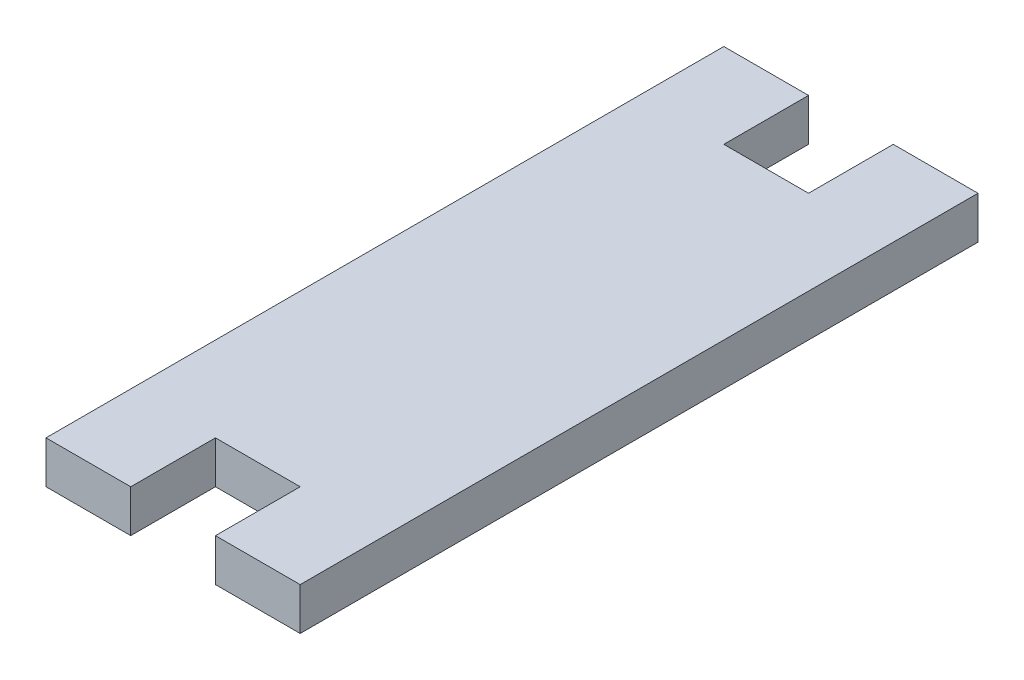
ISO-10303-21;
HEADER;
FILE_DESCRIPTION(('STEP AP214'),'2;1');
FILE_NAME('part.step','',(''),(''),'','','');
FILE_SCHEMA(('AUTOMOTIVE_DESIGN { 1 0 10303 214 1 1 1 1 }'));
ENDSEC;
DATA;
#1=APPLICATION_CONTEXT('core data for automotive mechanical design processes');
#2=APPLICATION_PROTOCOL_DEFINITION('international standard','automotive_design',2000,#1);
#3=PRODUCT_CONTEXT('',#1,'mechanical');
#4=PRODUCT('Part','Part','',(#3));
#5=PRODUCT_RELATED_PRODUCT_CATEGORY('part','',(#4));
#6=PRODUCT_DEFINITION_FORMATION('','',#4);
#7=PRODUCT_DEFINITION_CONTEXT('part definition',#1,'design');
#8=PRODUCT_DEFINITION('design','',#6,#7);
#9=PRODUCT_DEFINITION_SHAPE('','',#8);
#10=(LENGTH_UNIT() NAMED_UNIT(*) SI_UNIT(.MILLI.,.METRE.));
#11=(NAMED_UNIT(*) PLANE_ANGLE_UNIT() SI_UNIT($,.RADIAN.));
#12=(NAMED_UNIT(*) SI_UNIT($,.STERADIAN.) SOLID_ANGLE_UNIT());
#13=UNCERTAINTY_MEASURE_WITH_UNIT(LENGTH_MEASURE(1.E-05),#10,'distance_accuracy_value','');
#14=(GEOMETRIC_REPRESENTATION_CONTEXT(3) GLOBAL_UNCERTAINTY_ASSIGNED_CONTEXT((#13)) GLOBAL_UNIT_ASSIGNED_CONTEXT((#10,
#11,#12)) REPRESENTATION_CONTEXT('',''));
#15=CARTESIAN_POINT('',(0.,0.,0.));
#16=DIRECTION('',(0.,0.,1.));
#17=DIRECTION('',(1.,0.,0.));
#18=AXIS2_PLACEMENT_3D('',#15,#16,#17);
#19=CARTESIAN_POINT('',(0.,5.,0.));
#20=DIRECTION('',(0.,1.,0.));
#21=DIRECTION('',(0.,0.,1.));
#22=AXIS2_PLACEMENT_3D('',#19,#20,#21);
#23=PLANE('',#22);
#24=DIRECTION('',(-1.,0.,0.));
#25=VECTOR('',#24,1.);
#26=CARTESIAN_POINT('',(-29.9699480181936,5.,35.3086419753086));
#27=LINE('',#26,#25);
#28=CARTESIAN_POINT('',(-19.9699480181936,5.,35.3086419753086));
#29=VERTEX_POINT('',#28);
#30=CARTESIAN_POINT('',(-29.9699480181936,5.,35.3086419753086));
#31=VERTEX_POINT('',#30);
#32=EDGE_CURVE('E144',#29,#31,#27,.T.);
#33=ORIENTED_EDGE('',*,*,#32,.F.);
#34=DIRECTION('',(0.,0.,-1.));
#35=VECTOR('',#34,1.);
#36=CARTESIAN_POINT('',(-19.9699480181937,5.,45.3086419753086));
#37=LINE('',#36,#35);
#38=CARTESIAN_POINT('',(-19.9699480181937,5.,45.3086419753086));
#39=VERTEX_POINT('',#38);
#40=EDGE_CURVE('E130',#39,#29,#37,.T.);
#41=ORIENTED_EDGE('',*,*,#40,.F.);
#42=DIRECTION('',(1.,0.,0.));
#43=VECTOR('',#42,1.);
#44=CARTESIAN_POINT('',(-39.9699480181936,5.,45.3086419753086));
#45=LINE('',#44,#43);
#46=CARTESIAN_POINT('',(-9.96994801819363,5.,45.3086419753086));
#47=VERTEX_POINT('',#46);
#48=EDGE_CURVE('E142',#39,#47,#45,.T.);
#49=ORIENTED_EDGE('',*,*,#48,.T.);
#50=DIRECTION('',(0.,0.,-1.));
#51=VECTOR('',#50,1.);
#52=CARTESIAN_POINT('',(-9.96994801819364,5.,-34.6913580246914));
#53=LINE('',#52,#51);
#54=CARTESIAN_POINT('',(-9.96994801819364,5.,-34.6913580246914));
#55=VERTEX_POINT('',#54);
#56=EDGE_CURVE('E154',#47,#55,#53,.T.);
#57=ORIENTED_EDGE('',*,*,#56,.T.);
#58=DIRECTION('',(-1.,0.,0.));
#59=VECTOR('',#58,1.);
#60=CARTESIAN_POINT('',(-39.9699480181936,5.,-34.6913580246914));
#61=LINE('',#60,#59);
#62=CARTESIAN_POINT('',(-19.9699480181936,5.,-34.6913580246914));
#63=VERTEX_POINT('',#62);
#64=EDGE_CURVE('E162',#55,#63,#61,.T.);
#65=ORIENTED_EDGE('',*,*,#64,.T.);
#66=DIRECTION('',(0.,0.,-1.));
#67=VECTOR('',#66,1.);
#68=CARTESIAN_POINT('',(-19.9699480181936,5.,-34.6913580246914));
#69=LINE('',#68,#67);
#70=CARTESIAN_POINT('',(-19.9699480181936,5.,-24.6913580246914));
#71=VERTEX_POINT('',#70);
#72=EDGE_CURVE('E197',#71,#63,#69,.T.);
#73=ORIENTED_EDGE('',*,*,#72,.F.);
#74=DIRECTION('',(1.,0.,0.));
#75=VECTOR('',#74,1.);
#76=CARTESIAN_POINT('',(-29.9699480181936,5.,-24.6913580246914));
#77=LINE('',#76,#75);
#78=CARTESIAN_POINT('',(-29.9699480181936,5.,-24.6913580246914));
#79=VERTEX_POINT('',#78);
#80=EDGE_CURVE('E199',#79,#71,#77,.T.);
#81=ORIENTED_EDGE('',*,*,#80,.F.);
#82=DIRECTION('',(0.,0.,1.));
#83=VECTOR('',#82,1.);
#84=CARTESIAN_POINT('',(-29.9699480181936,5.,-34.6913580246914));
#85=LINE('',#84,#83);
#86=CARTESIAN_POINT('',(-29.9699480181936,5.,-34.6913580246914));
#87=VERTEX_POINT('',#86);
#88=EDGE_CURVE('E205',#87,#79,#85,.T.);
#89=ORIENTED_EDGE('',*,*,#88,.F.);
#90=CARTESIAN_POINT('',(-39.9699480181936,5.,-34.6913580246914));
#91=VERTEX_POINT('',#90);
#92=EDGE_CURVE('E161',#87,#91,#61,.T.);
#93=ORIENTED_EDGE('',*,*,#92,.T.);
#94=DIRECTION('',(0.,0.,1.));
#95=VECTOR('',#94,1.);
#96=CARTESIAN_POINT('',(-39.9699480181936,5.,-34.6913580246914));
#97=LINE('',#96,#95);
#98=CARTESIAN_POINT('',(-39.9699480181936,5.,45.3086419753086));
#99=VERTEX_POINT('',#98);
#100=EDGE_CURVE('E151',#91,#99,#97,.T.);
#101=ORIENTED_EDGE('',*,*,#100,.T.);
#102=CARTESIAN_POINT('',(-29.9699480181936,5.,45.3086419753086));
#103=VERTEX_POINT('',#102);
#104=EDGE_CURVE('E150',#99,#103,#45,.T.);
#105=ORIENTED_EDGE('',*,*,#104,.T.);
#106=DIRECTION('',(0.,0.,1.));
#107=VECTOR('',#106,1.);
#108=CARTESIAN_POINT('',(-29.9699480181936,5.,45.3086419753086));
#109=LINE('',#108,#107);
#110=EDGE_CURVE('E52',#31,#103,#109,.T.);
#111=ORIENTED_EDGE('',*,*,#110,.F.);
#112=EDGE_LOOP('',(#33,#41,#49,#57,#65,#73,#81,#89,#93,#101,#105,#111));
#113=FACE_BOUND('',#112,.T.);
#114=ADVANCED_FACE('F37',(#113),#23,.T.);
#115=CARTESIAN_POINT('',(0.,0.,0.));
#116=DIRECTION('',(0.,1.,0.));
#117=DIRECTION('',(0.,0.,1.));
#118=AXIS2_PLACEMENT_3D('',#115,#116,#117);
#119=PLANE('',#118);
#120=DIRECTION('',(0.,0.,-1.));
#121=VECTOR('',#120,1.);
#122=CARTESIAN_POINT('',(-19.9699480181937,0.,45.3086419753086));
#123=LINE('',#122,#121);
#124=CARTESIAN_POINT('',(-19.9699480181937,0.,45.3086419753086));
#125=VERTEX_POINT('',#124);
#126=CARTESIAN_POINT('',(-19.9699480181936,0.,35.3086419753086));
#127=VERTEX_POINT('',#126);
#128=EDGE_CURVE('E133',#125,#127,#123,.T.);
#129=ORIENTED_EDGE('',*,*,#128,.T.);
#130=DIRECTION('',(-1.,0.,0.));
#131=VECTOR('',#130,1.);
#132=CARTESIAN_POINT('',(-29.9699480181936,0.,35.3086419753086));
#133=LINE('',#132,#131);
#134=CARTESIAN_POINT('',(-29.9699480181936,0.,35.3086419753086));
#135=VERTEX_POINT('',#134);
#136=EDGE_CURVE('E238',#127,#135,#133,.T.);
#137=ORIENTED_EDGE('',*,*,#136,.T.);
#138=DIRECTION('',(0.,0.,1.));
#139=VECTOR('',#138,1.);
#140=CARTESIAN_POINT('',(-29.9699480181936,0.,45.3086419753086));
#141=LINE('',#140,#139);
#142=CARTESIAN_POINT('',(-29.9699480181936,0.,45.3086419753086));
#143=VERTEX_POINT('',#142);
#144=EDGE_CURVE('E145',#135,#143,#141,.T.);
#145=ORIENTED_EDGE('',*,*,#144,.T.);
#146=DIRECTION('',(1.,0.,0.));
#147=VECTOR('',#146,1.);
#148=CARTESIAN_POINT('',(-39.9699480181936,0.,45.3086419753086));
#149=LINE('',#148,#147);
#150=CARTESIAN_POINT('',(-39.9699480181936,0.,45.3086419753086));
#151=VERTEX_POINT('',#150);
#152=EDGE_CURVE('E171',#151,#143,#149,.T.);
#153=ORIENTED_EDGE('',*,*,#152,.F.);
#154=DIRECTION('',(0.,0.,1.));
#155=VECTOR('',#154,1.);
#156=CARTESIAN_POINT('',(-39.9699480181936,0.,-34.6913580246914));
#157=LINE('',#156,#155);
#158=CARTESIAN_POINT('',(-39.9699480181936,0.,-34.6913580246914));
#159=VERTEX_POINT('',#158);
#160=EDGE_CURVE('E166',#159,#151,#157,.T.);
#161=ORIENTED_EDGE('',*,*,#160,.F.);
#162=DIRECTION('',(-1.,0.,0.));
#163=VECTOR('',#162,1.);
#164=CARTESIAN_POINT('',(-39.9699480181936,0.,-34.6913580246914));
#165=LINE('',#164,#163);
#166=CARTESIAN_POINT('',(-29.9699480181936,0.,-34.6913580246914));
#167=VERTEX_POINT('',#166);
#168=EDGE_CURVE('E176',#167,#159,#165,.T.);
#169=ORIENTED_EDGE('',*,*,#168,.F.);
#170=DIRECTION('',(0.,0.,1.));
#171=VECTOR('',#170,1.);
#172=CARTESIAN_POINT('',(-29.9699480181936,0.,-34.6913580246914));
#173=LINE('',#172,#171);
#174=CARTESIAN_POINT('',(-29.9699480181936,0.,-24.6913580246914));
#175=VERTEX_POINT('',#174);
#176=EDGE_CURVE('E137',#167,#175,#173,.T.);
#177=ORIENTED_EDGE('',*,*,#176,.T.);
#178=DIRECTION('',(1.,0.,0.));
#179=VECTOR('',#178,1.);
#180=CARTESIAN_POINT('',(-29.9699480181936,0.,-24.6913580246914));
#181=LINE('',#180,#179);
#182=CARTESIAN_POINT('',(-19.9699480181936,0.,-24.6913580246914));
#183=VERTEX_POINT('',#182);
#184=EDGE_CURVE('E211',#175,#183,#181,.T.);
#185=ORIENTED_EDGE('',*,*,#184,.T.);
#186=DIRECTION('',(0.,0.,-1.));
#187=VECTOR('',#186,1.);
#188=CARTESIAN_POINT('',(-19.9699480181936,0.,-34.6913580246914));
#189=LINE('',#188,#187);
#190=CARTESIAN_POINT('',(-19.9699480181936,0.,-34.6913580246914));
#191=VERTEX_POINT('',#190);
#192=EDGE_CURVE('E191',#183,#191,#189,.T.);
#193=ORIENTED_EDGE('',*,*,#192,.T.);
#194=CARTESIAN_POINT('',(-9.96994801819364,0.,-34.6913580246914));
#195=VERTEX_POINT('',#194);
#196=EDGE_CURVE('E156',#195,#191,#165,.T.);
#197=ORIENTED_EDGE('',*,*,#196,.F.);
#198=DIRECTION('',(0.,0.,-1.));
#199=VECTOR('',#198,1.);
#200=CARTESIAN_POINT('',(-9.96994801819364,0.,-34.6913580246914));
#201=LINE('',#200,#199);
#202=CARTESIAN_POINT('',(-9.96994801819363,0.,45.3086419753086));
#203=VERTEX_POINT('',#202);
#204=EDGE_CURVE('E174',#203,#195,#201,.T.);
#205=ORIENTED_EDGE('',*,*,#204,.F.);
#206=EDGE_CURVE('E169',#125,#203,#149,.T.);
#207=ORIENTED_EDGE('',*,*,#206,.F.);
#208=EDGE_LOOP('',(#129,#137,#145,#153,#161,#169,#177,#185,#193,#197,#205,#207));
#209=FACE_BOUND('',#208,.T.);
#210=ADVANCED_FACE('F189',(#209),#119,.F.);
#211=CARTESIAN_POINT('',(-39.9699480181936,5.,45.3086419753086));
#212=DIRECTION('',(0.,0.,-1.));
#213=DIRECTION('',(-1.,0.,0.));
#214=AXIS2_PLACEMENT_3D('',#211,#212,#213);
#215=PLANE('',#214);
#216=DIRECTION('',(0.,-1.,0.));
#217=VECTOR('',#216,1.);
#218=CARTESIAN_POINT('',(-19.9699480181937,5.,45.3086419753086));
#219=LINE('',#218,#217);
#220=EDGE_CURVE('E127',#39,#125,#219,.T.);
#221=ORIENTED_EDGE('',*,*,#220,.T.);
#222=ORIENTED_EDGE('',*,*,#206,.T.);
#223=DIRECTION('',(0.,-1.,0.));
#224=VECTOR('',#223,1.);
#225=CARTESIAN_POINT('',(-9.96994801819363,5.,45.3086419753086));
#226=LINE('',#225,#224);
#227=EDGE_CURVE('E45',#47,#203,#226,.T.);
#228=ORIENTED_EDGE('',*,*,#227,.F.);
#229=ORIENTED_EDGE('',*,*,#48,.F.);
#230=EDGE_LOOP('',(#221,#222,#228,#229));
#231=FACE_BOUND('',#230,.T.);
#232=ADVANCED_FACE('F147',(#231),#215,.F.);
#233=DIRECTION('',(0.,-1.,0.));
#234=VECTOR('',#233,1.);
#235=CARTESIAN_POINT('',(-29.9699480181936,5.,45.3086419753086));
#236=LINE('',#235,#234);
#237=EDGE_CURVE('E234',#103,#143,#236,.T.);
#238=ORIENTED_EDGE('',*,*,#237,.F.);
#239=ORIENTED_EDGE('',*,*,#104,.F.);
#240=DIRECTION('',(0.,-1.,0.));
#241=VECTOR('',#240,1.);
#242=CARTESIAN_POINT('',(-39.9699480181936,5.,45.3086419753086));
#243=LINE('',#242,#241);
#244=EDGE_CURVE('E11',#99,#151,#243,.T.);
#245=ORIENTED_EDGE('',*,*,#244,.T.);
#246=ORIENTED_EDGE('',*,*,#152,.T.);
#247=EDGE_LOOP('',(#238,#239,#245,#246));
#248=FACE_BOUND('',#247,.T.);
#249=ADVANCED_FACE('F249',(#248),#215,.F.);
#250=CARTESIAN_POINT('',(-39.9699480181936,5.,-34.6913580246914));
#251=DIRECTION('',(0.,0.,1.));
#252=DIRECTION('',(1.,0.,0.));
#253=AXIS2_PLACEMENT_3D('',#250,#251,#252);
#254=PLANE('',#253);
#255=DIRECTION('',(0.,-1.,0.));
#256=VECTOR('',#255,1.);
#257=CARTESIAN_POINT('',(-29.9699480181936,5.,-34.6913580246914));
#258=LINE('',#257,#256);
#259=EDGE_CURVE('E201',#87,#167,#258,.T.);
#260=ORIENTED_EDGE('',*,*,#259,.T.);
#261=ORIENTED_EDGE('',*,*,#168,.T.);
#262=DIRECTION('',(0.,-1.,0.));
#263=VECTOR('',#262,1.);
#264=CARTESIAN_POINT('',(-39.9699480181936,5.,-34.6913580246914));
#265=LINE('',#264,#263);
#266=EDGE_CURVE('E165',#91,#159,#265,.T.);
#267=ORIENTED_EDGE('',*,*,#266,.F.);
#268=ORIENTED_EDGE('',*,*,#92,.F.);
#269=EDGE_LOOP('',(#260,#261,#267,#268));
#270=FACE_BOUND('',#269,.T.);
#271=ADVANCED_FACE('F225',(#270),#254,.F.);
#272=DIRECTION('',(0.,-1.,0.));
#273=VECTOR('',#272,1.);
#274=CARTESIAN_POINT('',(-19.9699480181936,5.,-34.6913580246914));
#275=LINE('',#274,#273);
#276=EDGE_CURVE('E60',#63,#191,#275,.T.);
#277=ORIENTED_EDGE('',*,*,#276,.F.);
#278=ORIENTED_EDGE('',*,*,#64,.F.);
#279=DIRECTION('',(0.,-1.,0.));
#280=VECTOR('',#279,1.);
#281=CARTESIAN_POINT('',(-9.96994801819364,5.,-34.6913580246914));
#282=LINE('',#281,#280);
#283=EDGE_CURVE('E181',#55,#195,#282,.T.);
#284=ORIENTED_EDGE('',*,*,#283,.T.);
#285=ORIENTED_EDGE('',*,*,#196,.T.);
#286=EDGE_LOOP('',(#277,#278,#284,#285));
#287=FACE_BOUND('',#286,.T.);
#288=ADVANCED_FACE('F193',(#287),#254,.F.);
#289=CARTESIAN_POINT('',(-39.9699480181936,5.,-34.6913580246914));
#290=DIRECTION('',(1.,0.,0.));
#291=DIRECTION('',(0.,0.,-1.));
#292=AXIS2_PLACEMENT_3D('',#289,#290,#291);
#293=PLANE('',#292);
#294=ORIENTED_EDGE('',*,*,#160,.T.);
#295=ORIENTED_EDGE('',*,*,#244,.F.);
#296=ORIENTED_EDGE('',*,*,#100,.F.);
#297=ORIENTED_EDGE('',*,*,#266,.T.);
#298=EDGE_LOOP('',(#294,#295,#296,#297));
#299=FACE_BOUND('',#298,.T.);
#300=ADVANCED_FACE('F39',(#299),#293,.F.);
#301=CARTESIAN_POINT('',(-9.96994801819364,5.,-34.6913580246914));
#302=DIRECTION('',(-1.,0.,0.));
#303=DIRECTION('',(0.,0.,1.));
#304=AXIS2_PLACEMENT_3D('',#301,#302,#303);
#305=PLANE('',#304);
#306=ORIENTED_EDGE('',*,*,#204,.T.);
#307=ORIENTED_EDGE('',*,*,#283,.F.);
#308=ORIENTED_EDGE('',*,*,#56,.F.);
#309=ORIENTED_EDGE('',*,*,#227,.T.);
#310=EDGE_LOOP('',(#306,#307,#308,#309));
#311=FACE_BOUND('',#310,.T.);
#312=ADVANCED_FACE('F185',(#311),#305,.F.);
#313=CARTESIAN_POINT('',(-29.9699480181936,5.,-34.6913580246914));
#314=DIRECTION('',(1.,0.,0.));
#315=DIRECTION('',(0.,0.,-1.));
#316=AXIS2_PLACEMENT_3D('',#313,#314,#315);
#317=PLANE('',#316);
#318=ORIENTED_EDGE('',*,*,#176,.F.);
#319=ORIENTED_EDGE('',*,*,#259,.F.);
#320=ORIENTED_EDGE('',*,*,#88,.T.);
#321=DIRECTION('',(0.,-1.,0.));
#322=VECTOR('',#321,1.);
#323=CARTESIAN_POINT('',(-29.9699480181936,5.,-24.6913580246914));
#324=LINE('',#323,#322);
#325=EDGE_CURVE('E170',#79,#175,#324,.T.);
#326=ORIENTED_EDGE('',*,*,#325,.T.);
#327=EDGE_LOOP('',(#318,#319,#320,#326));
#328=FACE_BOUND('',#327,.T.);
#329=ADVANCED_FACE('F219',(#328),#317,.T.);
#330=CARTESIAN_POINT('',(-29.9699480181936,5.,-24.6913580246914));
#331=DIRECTION('',(0.,0.,-1.));
#332=DIRECTION('',(-1.,0.,0.));
#333=AXIS2_PLACEMENT_3D('',#330,#331,#332);
#334=PLANE('',#333);
#335=ORIENTED_EDGE('',*,*,#184,.F.);
#336=ORIENTED_EDGE('',*,*,#325,.F.);
#337=ORIENTED_EDGE('',*,*,#80,.T.);
#338=DIRECTION('',(0.,-1.,0.));
#339=VECTOR('',#338,1.);
#340=CARTESIAN_POINT('',(-19.9699480181936,5.,-24.6913580246914));
#341=LINE('',#340,#339);
#342=EDGE_CURVE('E215',#71,#183,#341,.T.);
#343=ORIENTED_EDGE('',*,*,#342,.T.);
#344=EDGE_LOOP('',(#335,#336,#337,#343));
#345=FACE_BOUND('',#344,.T.);
#346=ADVANCED_FACE('F270',(#345),#334,.T.);
#347=CARTESIAN_POINT('',(-19.9699480181936,5.,-34.6913580246914));
#348=DIRECTION('',(-1.,0.,0.));
#349=DIRECTION('',(0.,0.,1.));
#350=AXIS2_PLACEMENT_3D('',#347,#348,#349);
#351=PLANE('',#350);
#352=ORIENTED_EDGE('',*,*,#192,.F.);
#353=ORIENTED_EDGE('',*,*,#342,.F.);
#354=ORIENTED_EDGE('',*,*,#72,.T.);
#355=ORIENTED_EDGE('',*,*,#276,.T.);
#356=EDGE_LOOP('',(#352,#353,#354,#355));
#357=FACE_BOUND('',#356,.T.);
#358=ADVANCED_FACE('F325',(#357),#351,.T.);
#359=CARTESIAN_POINT('',(-19.9699480181937,5.,45.3086419753086));
#360=DIRECTION('',(-1.,0.,0.));
#361=DIRECTION('',(0.,0.,1.));
#362=AXIS2_PLACEMENT_3D('',#359,#360,#361);
#363=PLANE('',#362);
#364=ORIENTED_EDGE('',*,*,#128,.F.);
#365=ORIENTED_EDGE('',*,*,#220,.F.);
#366=ORIENTED_EDGE('',*,*,#40,.T.);
#367=DIRECTION('',(0.,-1.,0.));
#368=VECTOR('',#367,1.);
#369=CARTESIAN_POINT('',(-19.9699480181936,5.,35.3086419753086));
#370=LINE('',#369,#368);
#371=EDGE_CURVE('E138',#29,#127,#370,.T.);
#372=ORIENTED_EDGE('',*,*,#371,.T.);
#373=EDGE_LOOP('',(#364,#365,#366,#372));
#374=FACE_BOUND('',#373,.T.);
#375=ADVANCED_FACE('F129',(#374),#363,.T.);
#376=CARTESIAN_POINT('',(-29.9699480181936,5.,35.3086419753086));
#377=DIRECTION('',(0.,0.,1.));
#378=DIRECTION('',(1.,0.,0.));
#379=AXIS2_PLACEMENT_3D('',#376,#377,#378);
#380=PLANE('',#379);
#381=ORIENTED_EDGE('',*,*,#136,.F.);
#382=ORIENTED_EDGE('',*,*,#371,.F.);
#383=ORIENTED_EDGE('',*,*,#32,.T.);
#384=DIRECTION('',(0.,-1.,0.));
#385=VECTOR('',#384,1.);
#386=CARTESIAN_POINT('',(-29.9699480181936,5.,35.3086419753086));
#387=LINE('',#386,#385);
#388=EDGE_CURVE('E232',#31,#135,#387,.T.);
#389=ORIENTED_EDGE('',*,*,#388,.T.);
#390=EDGE_LOOP('',(#381,#382,#383,#389));
#391=FACE_BOUND('',#390,.T.);
#392=ADVANCED_FACE('F245',(#391),#380,.T.);
#393=CARTESIAN_POINT('',(-29.9699480181936,5.,45.3086419753086));
#394=DIRECTION('',(1.,0.,0.));
#395=DIRECTION('',(0.,0.,-1.));
#396=AXIS2_PLACEMENT_3D('',#393,#394,#395);
#397=PLANE('',#396);
#398=ORIENTED_EDGE('',*,*,#144,.F.);
#399=ORIENTED_EDGE('',*,*,#388,.F.);
#400=ORIENTED_EDGE('',*,*,#110,.T.);
#401=ORIENTED_EDGE('',*,*,#237,.T.);
#402=EDGE_LOOP('',(#398,#399,#400,#401));
#403=FACE_BOUND('',#402,.T.);
#404=ADVANCED_FACE('F247',(#403),#397,.T.);
#405=CLOSED_SHELL('',(#114,#210,#232,#249,#271,#288,#300,#312,#329,#346,#358,#375,#392,#404));
#406=MANIFOLD_SOLID_BREP('B2',#405);
#407=ADVANCED_BREP_SHAPE_REPRESENTATION('',(#18,#406),#14);
#408=SHAPE_DEFINITION_REPRESENTATION(#9,#407);
ENDSEC;
END-ISO-10303-21;
